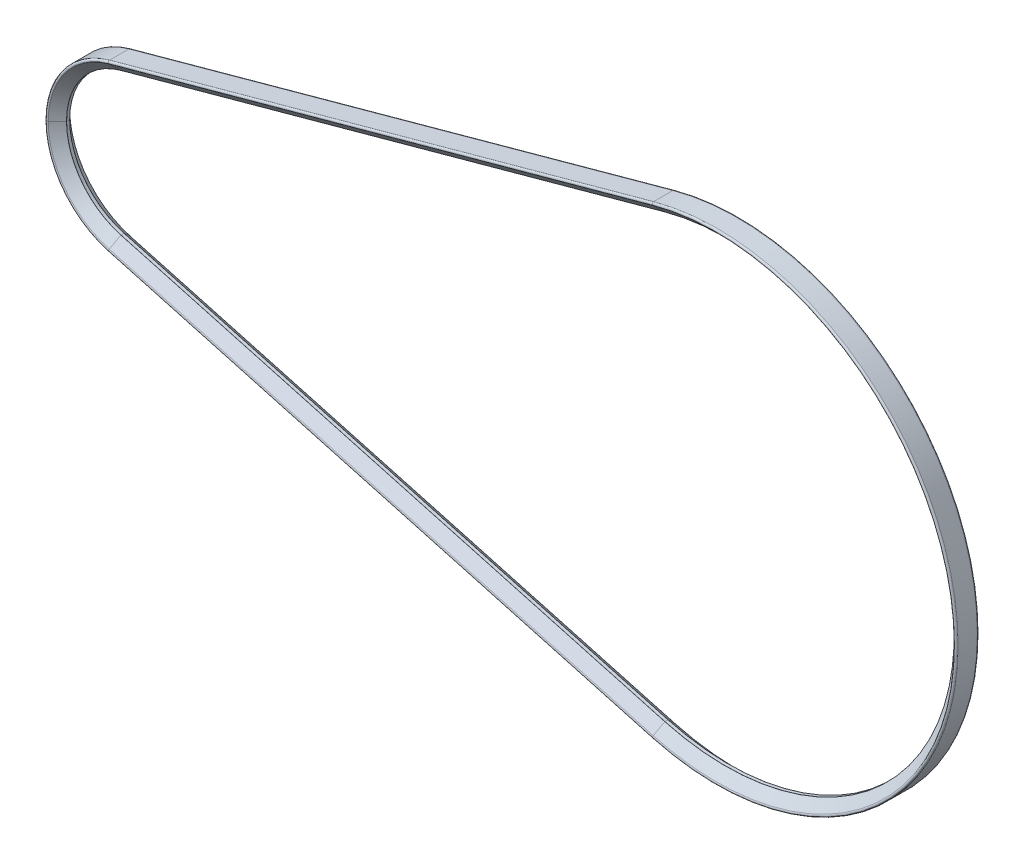
ISO-10303-21;
HEADER;
FILE_DESCRIPTION(('STEP AP214'),'2;1');
FILE_NAME('part.step','',(''),(''),'','','');
FILE_SCHEMA(('AUTOMOTIVE_DESIGN { 1 0 10303 214 1 1 1 1 }'));
ENDSEC;
DATA;
#1=APPLICATION_CONTEXT('core data for automotive mechanical design processes');
#2=APPLICATION_PROTOCOL_DEFINITION('international standard','automotive_design',2000,#1);
#3=PRODUCT_CONTEXT('',#1,'mechanical');
#4=PRODUCT('Part','Part','',(#3));
#5=PRODUCT_RELATED_PRODUCT_CATEGORY('part','',(#4));
#6=PRODUCT_DEFINITION_FORMATION('','',#4);
#7=PRODUCT_DEFINITION_CONTEXT('part definition',#1,'design');
#8=PRODUCT_DEFINITION('design','',#6,#7);
#9=PRODUCT_DEFINITION_SHAPE('','',#8);
#10=(LENGTH_UNIT() NAMED_UNIT(*) SI_UNIT(.MILLI.,.METRE.));
#11=(NAMED_UNIT(*) PLANE_ANGLE_UNIT() SI_UNIT($,.RADIAN.));
#12=(NAMED_UNIT(*) SI_UNIT($,.STERADIAN.) SOLID_ANGLE_UNIT());
#13=UNCERTAINTY_MEASURE_WITH_UNIT(LENGTH_MEASURE(1.E-05),#10,'distance_accuracy_value','');
#14=(GEOMETRIC_REPRESENTATION_CONTEXT(3) GLOBAL_UNCERTAINTY_ASSIGNED_CONTEXT((#13)) GLOBAL_UNIT_ASSIGNED_CONTEXT((#10,
#11,#12)) REPRESENTATION_CONTEXT('',''));
#15=CARTESIAN_POINT('',(0.,0.,0.));
#16=DIRECTION('',(0.,0.,1.));
#17=DIRECTION('',(1.,0.,0.));
#18=AXIS2_PLACEMENT_3D('',#15,#16,#17);
#19=CARTESIAN_POINT('',(-36.9999999999975,-8.77076189453874E-12,0.));
#20=DIRECTION('',(0.,0.,-1.));
#21=DIRECTION('',(-1.,0.,0.));
#22=AXIS2_PLACEMENT_3D('',#19,#20,#21);
#23=CYLINDRICAL_SURFACE('',#22,4.675);
#24=DIRECTION('',(0.,0.,-1.));
#25=VECTOR('',#24,1.);
#26=CARTESIAN_POINT('',(-38.2382432432398,-4.50803490122292,0.0999999999999893));
#27=LINE('',#26,#25);
#28=CARTESIAN_POINT('',(-38.2382432432398,-4.50803490122292,0.095857864376263));
#29=VERTEX_POINT('',#28);
#30=CARTESIAN_POINT('',(-38.2382432432398,-4.50803490122292,-0.0958578643762605));
#31=VERTEX_POINT('',#30);
#32=EDGE_CURVE('E220',#29,#31,#27,.T.);
#33=ORIENTED_EDGE('',*,*,#32,.T.);
#34=CARTESIAN_POINT('',(-36.9999999999975,-8.77076189453874E-12,-0.0958578643762606));
#35=DIRECTION('',(0.,0.,1.));
#36=DIRECTION('',(1.,0.,0.));
#37=AXIS2_PLACEMENT_3D('',#34,#35,#36);
#38=CIRCLE('',#37,4.675);
#39=CARTESIAN_POINT('',(-41.6749999999975,0.,-0.0958578643762606));
#40=VERTEX_POINT('',#39);
#41=EDGE_CURVE('E306',#31,#40,#38,.F.);
#42=ORIENTED_EDGE('',*,*,#41,.T.);
#43=DIRECTION('',(0.,0.,-1.));
#44=VECTOR('',#43,1.);
#45=CARTESIAN_POINT('',(-41.6749999999975,0.,0.0999999999999893));
#46=LINE('',#45,#44);
#47=CARTESIAN_POINT('',(-41.6749999999975,0.,0.0958578643762572));
#48=VERTEX_POINT('',#47);
#49=EDGE_CURVE('E192',#48,#40,#46,.T.);
#50=ORIENTED_EDGE('',*,*,#49,.F.);
#51=CARTESIAN_POINT('',(-36.9999999999975,-8.77076189453874E-12,0.0958578643762572));
#52=DIRECTION('',(0.,0.,1.));
#53=DIRECTION('',(1.,0.,0.));
#54=AXIS2_PLACEMENT_3D('',#51,#52,#53);
#55=CIRCLE('',#54,4.675);
#56=EDGE_CURVE('E304',#48,#29,#55,.T.);
#57=ORIENTED_EDGE('',*,*,#56,.T.);
#58=EDGE_LOOP('',(#33,#42,#50,#57));
#59=FACE_BOUND('',#58,.T.);
#60=ADVANCED_FACE('F39',(#59),#23,.F.);
#61=CARTESIAN_POINT('',(-36.9999999999975,-8.77076189453874E-12,0.85));
#62=DIRECTION('',(0.,0.,1.));
#63=DIRECTION('',(1.,0.,0.));
#64=AXIS2_PLACEMENT_3D('',#61,#62,#63);
#65=CONICAL_SURFACE('',#64,5.425,0.785398163397442);
#66=DIRECTION('',(0.187287742042575,0.681852844593749,-0.707106781186552));
#67=VECTOR('',#66,1.);
#68=CARTESIAN_POINT('',(-38.4368918918869,-5.23124905649829,0.85));
#69=LINE('',#68,#67);
#70=CARTESIAN_POINT('',(-38.3916766311964,-5.0666352180022,0.679289321881344));
#71=VERTEX_POINT('',#70);
#72=CARTESIAN_POINT('',(-38.239019014468,-4.51085922818066,0.102928932188128));
#73=VERTEX_POINT('',#72);
#74=EDGE_CURVE('E225',#71,#73,#69,.T.);
#75=ORIENTED_EDGE('',*,*,#74,.T.);
#76=CARTESIAN_POINT('',(-36.9999999999975,-8.77076189453874E-12,0.10292893218812));
#77=DIRECTION('',(0.,0.,-1.));
#78=DIRECTION('',(-1.,0.,0.));
#79=AXIS2_PLACEMENT_3D('',#76,#77,#78);
#80=CIRCLE('',#79,4.67792893218813);
#81=CARTESIAN_POINT('',(-41.6779289321857,0.,0.102928932188124));
#82=VERTEX_POINT('',#81);
#83=EDGE_CURVE('E61',#73,#82,#80,.T.);
#84=ORIENTED_EDGE('',*,*,#83,.T.);
#85=DIRECTION('',(0.707106781186543,0.,-0.707106781186552));
#86=VECTOR('',#85,1.);
#87=CARTESIAN_POINT('',(-42.4249999999975,0.,0.85));
#88=LINE('',#87,#86);
#89=CARTESIAN_POINT('',(-42.2542893218789,0.,0.679289321881346));
#90=VERTEX_POINT('',#89);
#91=EDGE_CURVE('E362',#90,#82,#88,.T.);
#92=ORIENTED_EDGE('',*,*,#91,.F.);
#93=CARTESIAN_POINT('',(-36.9999999999975,-8.77076189453874E-12,0.679289321881344));
#94=DIRECTION('',(0.,0.,-1.));
#95=DIRECTION('',(-1.,0.,0.));
#96=AXIS2_PLACEMENT_3D('',#93,#94,#95);
#97=CIRCLE('',#96,5.25428932188135);
#98=EDGE_CURVE('E253',#90,#71,#97,.F.);
#99=ORIENTED_EDGE('',*,*,#98,.T.);
#100=EDGE_LOOP('',(#75,#84,#92,#99));
#101=FACE_BOUND('',#100,.T.);
#102=ADVANCED_FACE('F449',(#101),#65,.F.);
#103=CARTESIAN_POINT('',(-36.9999999999975,-8.77076189453874E-12,0.));
#104=DIRECTION('',(0.,0.,-1.));
#105=DIRECTION('',(-1.,0.,0.));
#106=AXIS2_PLACEMENT_3D('',#103,#104,#105);
#107=CYLINDRICAL_SURFACE('',#106,5.425);
#108=DIRECTION('',(0.,0.,1.));
#109=VECTOR('',#108,1.);
#110=CARTESIAN_POINT('',(-42.4249999999975,0.,-0.85));
#111=LINE('',#110,#109);
#112=CARTESIAN_POINT('',(-42.4249999999975,0.,-0.608578643762691));
#113=VERTEX_POINT('',#112);
#114=CARTESIAN_POINT('',(-42.4249999999975,0.,0.608578643762692));
#115=VERTEX_POINT('',#114);
#116=EDGE_CURVE('E403',#113,#115,#111,.T.);
#117=ORIENTED_EDGE('',*,*,#116,.F.);
#118=CARTESIAN_POINT('',(-36.9999999999975,-8.77076189453874E-12,-0.608578643762691));
#119=DIRECTION('',(0.,0.,1.));
#120=DIRECTION('',(1.,0.,0.));
#121=AXIS2_PLACEMENT_3D('',#118,#119,#120);
#122=CIRCLE('',#121,5.425);
#123=CARTESIAN_POINT('',(-38.4368918918869,-5.23124905649829,-0.608578643762687));
#124=VERTEX_POINT('',#123);
#125=EDGE_CURVE('E234',#113,#124,#122,.T.);
#126=ORIENTED_EDGE('',*,*,#125,.T.);
#127=DIRECTION('',(0.,0.,1.));
#128=VECTOR('',#127,1.);
#129=CARTESIAN_POINT('',(-38.4368918918869,-5.23124905649829,-0.85));
#130=LINE('',#129,#128);
#131=CARTESIAN_POINT('',(-38.4368918918869,-5.23124905649829,0.60857864376269));
#132=VERTEX_POINT('',#131);
#133=EDGE_CURVE('E387',#124,#132,#130,.T.);
#134=ORIENTED_EDGE('',*,*,#133,.T.);
#135=CARTESIAN_POINT('',(-36.9999999999975,-8.77076189453874E-12,0.608578643762692));
#136=DIRECTION('',(0.,0.,1.));
#137=DIRECTION('',(1.,0.,0.));
#138=AXIS2_PLACEMENT_3D('',#135,#136,#137);
#139=CIRCLE('',#138,5.425);
#140=EDGE_CURVE('E232',#132,#115,#139,.F.);
#141=ORIENTED_EDGE('',*,*,#140,.T.);
#142=EDGE_LOOP('',(#117,#126,#134,#141));
#143=FACE_BOUND('',#142,.T.);
#144=ADVANCED_FACE('F462',(#143),#107,.T.);
#145=CARTESIAN_POINT('',(-3.83391891891587,-13.9580331968075,0.0999999999999893));
#146=DIRECTION('',(0.264864864864654,0.964285540366664,0.));
#147=DIRECTION('',(-0.964285540366664,0.264864864864654,0.));
#148=AXIS2_PLACEMENT_3D('',#145,#146,#147);
#149=PLANE('',#148);
#150=DIRECTION('',(0.,0.,-1.));
#151=VECTOR('',#150,1.);
#152=CARTESIAN_POINT('',(-3.83391891891586,-13.9580331968075,0.0999999999999893));
#153=LINE('',#152,#151);
#154=CARTESIAN_POINT('',(-3.83391891891586,-13.9580331968075,0.0958578643762621));
#155=VERTEX_POINT('',#154);
#156=CARTESIAN_POINT('',(-3.83391891891586,-13.9580331968075,-0.0958578643762595));
#157=VERTEX_POINT('',#156);
#158=EDGE_CURVE('E384',#155,#157,#153,.T.);
#159=ORIENTED_EDGE('',*,*,#158,.T.);
#160=DIRECTION('',(-0.964285540366664,0.264864864864654,0.));
#161=VECTOR('',#160,1.);
#162=CARTESIAN_POINT('',(-3.83391891891587,-13.9580331968075,-0.0958578643762595));
#163=LINE('',#162,#161);
#164=EDGE_CURVE('E320',#157,#31,#163,.T.);
#165=ORIENTED_EDGE('',*,*,#164,.T.);
#166=ORIENTED_EDGE('',*,*,#32,.F.);
#167=DIRECTION('',(-0.964285540366664,0.264864864864654,0.));
#168=VECTOR('',#167,1.);
#169=CARTESIAN_POINT('',(-3.83391891891587,-13.9580331968075,0.0958578643762621));
#170=LINE('',#169,#168);
#171=EDGE_CURVE('E318',#29,#155,#170,.F.);
#172=ORIENTED_EDGE('',*,*,#171,.T.);
#173=EDGE_LOOP('',(#159,#165,#166,#172));
#174=FACE_BOUND('',#173,.T.);
#175=ADVANCED_FACE('F515',(#174),#149,.T.);
#176=CARTESIAN_POINT('',(-4.032567567563,-14.6812473520828,0.85));
#177=DIRECTION('',(0.187287742043857,0.681852844593407,0.707106781186543));
#178=DIRECTION('',(0.,-0.719844357976628,0.694135505711396));
#179=AXIS2_PLACEMENT_3D('',#176,#177,#178);
#180=PLANE('',#179);
#181=DIRECTION('',(0.187287742042575,0.681852844593749,-0.707106781186552));
#182=VECTOR('',#181,1.);
#183=CARTESIAN_POINT('',(-4.03256756756299,-14.6812473520828,0.85));
#184=LINE('',#183,#182);
#185=CARTESIAN_POINT('',(-3.98735230687245,-14.5166335135867,0.679289321881347));
#186=VERTEX_POINT('',#185);
#187=CARTESIAN_POINT('',(-3.83469469014406,-13.9608575237652,0.102928932188125));
#188=VERTEX_POINT('',#187);
#189=EDGE_CURVE('E382',#186,#188,#184,.T.);
#190=ORIENTED_EDGE('',*,*,#189,.T.);
#191=DIRECTION('',(-0.964285540366664,0.264864864864654,0.));
#192=VECTOR('',#191,1.);
#193=CARTESIAN_POINT('',(-3.83469469014272,-13.9608575237656,0.102928932188125));
#194=LINE('',#193,#192);
#195=EDGE_CURVE('E11',#188,#73,#194,.T.);
#196=ORIENTED_EDGE('',*,*,#195,.T.);
#197=ORIENTED_EDGE('',*,*,#74,.F.);
#198=DIRECTION('',(-0.964285540366664,0.264864864864654,0.));
#199=VECTOR('',#198,1.);
#200=CARTESIAN_POINT('',(-3.98735230687215,-14.5166335135868,0.679289321881343));
#201=LINE('',#200,#199);
#202=EDGE_CURVE('E255',#71,#186,#201,.F.);
#203=ORIENTED_EDGE('',*,*,#202,.T.);
#204=EDGE_LOOP('',(#190,#196,#197,#203));
#205=FACE_BOUND('',#204,.T.);
#206=ADVANCED_FACE('F452',(#205),#180,.T.);
#207=CARTESIAN_POINT('',(-4.032567567563,-14.6812473520828,-0.85));
#208=DIRECTION('',(-0.264864864864654,-0.964285540366664,0.));
#209=DIRECTION('',(0.964285540366664,-0.264864864864654,0.));
#210=AXIS2_PLACEMENT_3D('',#207,#208,#209);
#211=PLANE('',#210);
#212=ORIENTED_EDGE('',*,*,#133,.F.);
#213=DIRECTION('',(-0.964285540366664,0.264864864864654,0.));
#214=VECTOR('',#213,1.);
#215=CARTESIAN_POINT('',(-4.032567567563,-14.6812473520828,-0.608578643762687));
#216=LINE('',#215,#214);
#217=CARTESIAN_POINT('',(-4.03256756756299,-14.6812473520828,-0.608578643762686));
#218=VERTEX_POINT('',#217);
#219=EDGE_CURVE('E241',#124,#218,#216,.F.);
#220=ORIENTED_EDGE('',*,*,#219,.T.);
#221=DIRECTION('',(0.,0.,1.));
#222=VECTOR('',#221,1.);
#223=CARTESIAN_POINT('',(-4.03256756756299,-14.6812473520828,-0.85));
#224=LINE('',#223,#222);
#225=CARTESIAN_POINT('',(-4.03256756756299,-14.6812473520828,0.60857864376269));
#226=VERTEX_POINT('',#225);
#227=EDGE_CURVE('E385',#218,#226,#224,.T.);
#228=ORIENTED_EDGE('',*,*,#227,.T.);
#229=DIRECTION('',(-0.964285540366664,0.264864864864654,0.));
#230=VECTOR('',#229,1.);
#231=CARTESIAN_POINT('',(-4.032567567563,-14.6812473520828,0.608578643762689));
#232=LINE('',#231,#230);
#233=EDGE_CURVE('E239',#226,#132,#232,.T.);
#234=ORIENTED_EDGE('',*,*,#233,.T.);
#235=EDGE_LOOP('',(#212,#220,#228,#234));
#236=FACE_BOUND('',#235,.T.);
#237=ADVANCED_FACE('F465',(#236),#211,.T.);
#238=CARTESIAN_POINT('',(-3.83391891891587,-13.9580331968075,-0.0999999999999893));
#239=DIRECTION('',(0.187287742043857,0.681852844593407,-0.707106781186543));
#240=DIRECTION('',(0.,0.719844357976628,0.694135505711396));
#241=AXIS2_PLACEMENT_3D('',#238,#239,#240);
#242=PLANE('',#241);
#243=DIRECTION('',(-0.187287742042575,-0.681852844593749,-0.707106781186552));
#244=VECTOR('',#243,1.);
#245=CARTESIAN_POINT('',(-38.2382432432398,-4.50803490122292,-0.0999999999999893));
#246=LINE('',#245,#244);
#247=CARTESIAN_POINT('',(-38.239019014468,-4.51085922818066,-0.102928932188126));
#248=VERTEX_POINT('',#247);
#249=CARTESIAN_POINT('',(-38.3916766311964,-5.0666352180022,-0.679289321881343));
#250=VERTEX_POINT('',#249);
#251=EDGE_CURVE('E393',#248,#250,#246,.T.);
#252=ORIENTED_EDGE('',*,*,#251,.F.);
#253=DIRECTION('',(-0.964285540366664,0.264864864864654,0.));
#254=VECTOR('',#253,1.);
#255=CARTESIAN_POINT('',(-3.83469469014408,-13.9608575237652,-0.102928932188125));
#256=LINE('',#255,#254);
#257=CARTESIAN_POINT('',(-3.83469469014406,-13.9608575237652,-0.102928932188124));
#258=VERTEX_POINT('',#257);
#259=EDGE_CURVE('E48',#248,#258,#256,.F.);
#260=ORIENTED_EDGE('',*,*,#259,.T.);
#261=DIRECTION('',(-0.187287742042575,-0.681852844593749,-0.707106781186552));
#262=VECTOR('',#261,1.);
#263=CARTESIAN_POINT('',(-3.83391891891586,-13.9580331968075,-0.0999999999999893));
#264=LINE('',#263,#262);
#265=CARTESIAN_POINT('',(-3.98735230687245,-14.5166335135867,-0.679289321881344));
#266=VERTEX_POINT('',#265);
#267=EDGE_CURVE('E391',#258,#266,#264,.T.);
#268=ORIENTED_EDGE('',*,*,#267,.T.);
#269=DIRECTION('',(-0.964285540366664,0.264864864864654,0.));
#270=VECTOR('',#269,1.);
#271=CARTESIAN_POINT('',(-3.98735230687351,-14.5166335135864,-0.679289321881342));
#272=LINE('',#271,#270);
#273=EDGE_CURVE('E236',#266,#250,#272,.T.);
#274=ORIENTED_EDGE('',*,*,#273,.T.);
#275=EDGE_LOOP('',(#252,#260,#268,#274));
#276=FACE_BOUND('',#275,.T.);
#277=ADVANCED_FACE('F414',(#276),#242,.T.);
#278=CARTESIAN_POINT('',(0.,0.,0.));
#279=DIRECTION('',(0.,0.,-1.));
#280=DIRECTION('',(-1.,0.,0.));
#281=AXIS2_PLACEMENT_3D('',#278,#279,#280);
#282=CYLINDRICAL_SURFACE('',#281,14.475);
#283=DIRECTION('',(0.,0.,-1.));
#284=VECTOR('',#283,1.);
#285=CARTESIAN_POINT('',(-3.83391891892245,13.9580331968056,0.0999999999999893));
#286=LINE('',#285,#284);
#287=CARTESIAN_POINT('',(-3.83391891892245,13.9580331968056,0.0958578643762515));
#288=VERTEX_POINT('',#287);
#289=CARTESIAN_POINT('',(-3.83391891892245,13.9580331968056,-0.0958578643762561));
#290=VERTEX_POINT('',#289);
#291=EDGE_CURVE('E380',#288,#290,#286,.T.);
#292=ORIENTED_EDGE('',*,*,#291,.T.);
#293=CARTESIAN_POINT('',(0.,0.,-0.0958578643762572));
#294=DIRECTION('',(0.,0.,1.));
#295=DIRECTION('',(1.,0.,0.));
#296=AXIS2_PLACEMENT_3D('',#293,#294,#295);
#297=CIRCLE('',#296,14.475);
#298=EDGE_CURVE('E287',#290,#157,#297,.F.);
#299=ORIENTED_EDGE('',*,*,#298,.T.);
#300=ORIENTED_EDGE('',*,*,#158,.F.);
#301=CARTESIAN_POINT('',(0.,0.,0.0958578643762612));
#302=DIRECTION('',(0.,0.,1.));
#303=DIRECTION('',(1.,0.,0.));
#304=AXIS2_PLACEMENT_3D('',#301,#302,#303);
#305=CIRCLE('',#304,14.475);
#306=EDGE_CURVE('E262',#155,#288,#305,.T.);
#307=ORIENTED_EDGE('',*,*,#306,.T.);
#308=EDGE_LOOP('',(#292,#299,#300,#307));
#309=FACE_BOUND('',#308,.T.);
#310=ADVANCED_FACE('F497',(#309),#282,.F.);
#311=CARTESIAN_POINT('',(0.,0.,0.85));
#312=DIRECTION('',(0.,0.,1.));
#313=DIRECTION('',(1.,0.,0.));
#314=AXIS2_PLACEMENT_3D('',#311,#312,#313);
#315=CONICAL_SURFACE('',#314,15.225,0.785398163397443);
#316=DIRECTION('',(0.187287742045456,-0.681852844592958,-0.707106781186552));
#317=VECTOR('',#316,1.);
#318=CARTESIAN_POINT('',(-4.03256756757264,14.6812473520802,0.85));
#319=LINE('',#318,#317);
#320=CARTESIAN_POINT('',(-3.9873523068814,14.5166335135843,0.67928932188134));
#321=VERTEX_POINT('',#320);
#322=CARTESIAN_POINT('',(-3.83469469015066,13.9608575237634,0.102928932188117));
#323=VERTEX_POINT('',#322);
#324=EDGE_CURVE('E378',#321,#323,#319,.T.);
#325=ORIENTED_EDGE('',*,*,#324,.T.);
#326=CARTESIAN_POINT('',(0.,0.,0.102928932188127));
#327=DIRECTION('',(0.,0.,-1.));
#328=DIRECTION('',(-1.,0.,0.));
#329=AXIS2_PLACEMENT_3D('',#326,#327,#328);
#330=CIRCLE('',#329,14.4779289321881);
#331=EDGE_CURVE('E310',#323,#188,#330,.T.);
#332=ORIENTED_EDGE('',*,*,#331,.T.);
#333=ORIENTED_EDGE('',*,*,#189,.F.);
#334=CARTESIAN_POINT('',(0.,0.,0.679289321881344));
#335=DIRECTION('',(0.,0.,-1.));
#336=DIRECTION('',(-1.,0.,0.));
#337=AXIS2_PLACEMENT_3D('',#334,#335,#336);
#338=CIRCLE('',#337,15.0542893218814);
#339=EDGE_CURVE('E213',#186,#321,#338,.F.);
#340=ORIENTED_EDGE('',*,*,#339,.T.);
#341=EDGE_LOOP('',(#325,#332,#333,#340));
#342=FACE_BOUND('',#341,.T.);
#343=ADVANCED_FACE('F508',(#342),#315,.F.);
#344=CARTESIAN_POINT('',(0.,0.,0.));
#345=DIRECTION('',(0.,0.,-1.));
#346=DIRECTION('',(-1.,0.,0.));
#347=AXIS2_PLACEMENT_3D('',#344,#345,#346);
#348=CYLINDRICAL_SURFACE('',#347,15.225);
#349=ORIENTED_EDGE('',*,*,#227,.F.);
#350=CARTESIAN_POINT('',(0.,0.,-0.608578643762686));
#351=DIRECTION('',(0.,0.,1.));
#352=DIRECTION('',(1.,0.,0.));
#353=AXIS2_PLACEMENT_3D('',#350,#351,#352);
#354=CIRCLE('',#353,15.225);
#355=CARTESIAN_POINT('',(-4.03256756757264,14.6812473520802,-0.608578643762691));
#356=VERTEX_POINT('',#355);
#357=EDGE_CURVE('E248',#218,#356,#354,.T.);
#358=ORIENTED_EDGE('',*,*,#357,.T.);
#359=DIRECTION('',(0.,0.,1.));
#360=VECTOR('',#359,1.);
#361=CARTESIAN_POINT('',(-4.03256756757264,14.6812473520802,-0.85));
#362=LINE('',#361,#360);
#363=CARTESIAN_POINT('',(-4.03256756757264,14.6812473520802,0.608578643762686));
#364=VERTEX_POINT('',#363);
#365=EDGE_CURVE('E381',#356,#364,#362,.T.);
#366=ORIENTED_EDGE('',*,*,#365,.T.);
#367=CARTESIAN_POINT('',(0.,0.,0.60857864376269));
#368=DIRECTION('',(0.,0.,1.));
#369=DIRECTION('',(1.,0.,0.));
#370=AXIS2_PLACEMENT_3D('',#367,#368,#369);
#371=CIRCLE('',#370,15.225);
#372=EDGE_CURVE('E246',#364,#226,#371,.F.);
#373=ORIENTED_EDGE('',*,*,#372,.T.);
#374=EDGE_LOOP('',(#349,#358,#366,#373));
#375=FACE_BOUND('',#374,.T.);
#376=ADVANCED_FACE('F431',(#375),#348,.T.);
#377=CARTESIAN_POINT('',(0.,0.,-0.0999999999999893));
#378=DIRECTION('',(0.,0.,-1.));
#379=DIRECTION('',(-1.,0.,0.));
#380=AXIS2_PLACEMENT_3D('',#377,#378,#379);
#381=CONICAL_SURFACE('',#380,14.475,0.785398163397442);
#382=ORIENTED_EDGE('',*,*,#267,.F.);
#383=CARTESIAN_POINT('',(0.,0.,-0.102928932188122));
#384=DIRECTION('',(0.,0.,1.));
#385=DIRECTION('',(1.,0.,0.));
#386=AXIS2_PLACEMENT_3D('',#383,#384,#385);
#387=CIRCLE('',#386,14.4779289321881);
#388=CARTESIAN_POINT('',(-3.83469469015066,13.9608575237634,-0.102928932188122));
#389=VERTEX_POINT('',#388);
#390=EDGE_CURVE('E290',#258,#389,#387,.T.);
#391=ORIENTED_EDGE('',*,*,#390,.T.);
#392=DIRECTION('',(-0.187287742045456,0.681852844592958,-0.707106781186552));
#393=VECTOR('',#392,1.);
#394=CARTESIAN_POINT('',(-3.83391891892245,13.9580331968056,-0.0999999999999893));
#395=LINE('',#394,#393);
#396=CARTESIAN_POINT('',(-3.9873523068814,14.5166335135843,-0.679289321881345));
#397=VERTEX_POINT('',#396);
#398=EDGE_CURVE('E371',#389,#397,#395,.T.);
#399=ORIENTED_EDGE('',*,*,#398,.T.);
#400=CARTESIAN_POINT('',(0.,0.,-0.679289321881337));
#401=DIRECTION('',(0.,0.,1.));
#402=DIRECTION('',(1.,0.,0.));
#403=AXIS2_PLACEMENT_3D('',#400,#401,#402);
#404=CIRCLE('',#403,15.0542893218814);
#405=EDGE_CURVE('E243',#397,#266,#404,.F.);
#406=ORIENTED_EDGE('',*,*,#405,.T.);
#407=EDGE_LOOP('',(#382,#391,#399,#406));
#408=FACE_BOUND('',#407,.T.);
#409=ADVANCED_FACE('F420',(#408),#381,.F.);
#410=CARTESIAN_POINT('',(-38.2382432432419,4.50803490120479,0.0999999999999893));
#411=DIRECTION('',(0.264864864865111,-0.964285540366538,0.));
#412=DIRECTION('',(0.964285540366538,0.264864864865111,0.));
#413=AXIS2_PLACEMENT_3D('',#410,#411,#412);
#414=PLANE('',#413);
#415=DIRECTION('',(0.,0.,-1.));
#416=VECTOR('',#415,1.);
#417=CARTESIAN_POINT('',(-38.2382432432419,4.5080349012048,0.0999999999999893));
#418=LINE('',#417,#416);
#419=CARTESIAN_POINT('',(-38.2382432432419,4.5080349012048,0.0958578643762579));
#420=VERTEX_POINT('',#419);
#421=CARTESIAN_POINT('',(-38.2382432432419,4.5080349012048,-0.0958578643762573));
#422=VERTEX_POINT('',#421);
#423=EDGE_CURVE('E368',#420,#422,#418,.T.);
#424=ORIENTED_EDGE('',*,*,#423,.T.);
#425=DIRECTION('',(0.964285540366538,0.264864864865111,0.));
#426=VECTOR('',#425,1.);
#427=CARTESIAN_POINT('',(-38.2382432432419,4.50803490120479,-0.0958578643762577));
#428=LINE('',#427,#426);
#429=EDGE_CURVE('E295',#422,#290,#428,.T.);
#430=ORIENTED_EDGE('',*,*,#429,.T.);
#431=ORIENTED_EDGE('',*,*,#291,.F.);
#432=DIRECTION('',(0.964285540366538,0.264864864865111,0.));
#433=VECTOR('',#432,1.);
#434=CARTESIAN_POINT('',(-38.2382432432419,4.50803490120479,0.0958578643762532));
#435=LINE('',#434,#433);
#436=EDGE_CURVE('E293',#288,#420,#435,.F.);
#437=ORIENTED_EDGE('',*,*,#436,.T.);
#438=EDGE_LOOP('',(#424,#430,#431,#437));
#439=FACE_BOUND('',#438,.T.);
#440=ADVANCED_FACE('F494',(#439),#414,.T.);
#441=CARTESIAN_POINT('',(-38.4368918918921,5.23124905647933,0.85));
#442=DIRECTION('',(0.18728774204418,-0.681852844593318,0.707106781186543));
#443=DIRECTION('',(0.,-0.719844357976673,-0.694135505711349));
#444=AXIS2_PLACEMENT_3D('',#441,#442,#443);
#445=PLANE('',#444);
#446=DIRECTION('',(0.187287742045457,-0.681852844592957,-0.707106781186552));
#447=VECTOR('',#446,1.);
#448=CARTESIAN_POINT('',(-38.4368918918921,5.23124905647933,0.85));
#449=LINE('',#448,#447);
#450=CARTESIAN_POINT('',(-38.3916766312009,5.06663521798343,0.679289321881342));
#451=VERTEX_POINT('',#450);
#452=CARTESIAN_POINT('',(-38.2390190144701,4.51085922816252,0.10292893218812));
#453=VERTEX_POINT('',#452);
#454=EDGE_CURVE('E360',#451,#453,#449,.T.);
#455=ORIENTED_EDGE('',*,*,#454,.T.);
#456=DIRECTION('',(0.964285540366538,0.264864864865111,0.));
#457=VECTOR('',#456,1.);
#458=CARTESIAN_POINT('',(-38.2390190144715,4.51085922816215,0.102928932188119));
#459=LINE('',#458,#457);
#460=EDGE_CURVE('E313',#453,#323,#459,.T.);
#461=ORIENTED_EDGE('',*,*,#460,.T.);
#462=ORIENTED_EDGE('',*,*,#324,.F.);
#463=DIRECTION('',(0.964285540366538,0.264864864865111,0.));
#464=VECTOR('',#463,1.);
#465=CARTESIAN_POINT('',(-38.3916766312012,5.06663521798334,0.679289321881342));
#466=LINE('',#465,#464);
#467=EDGE_CURVE('E261',#321,#451,#466,.F.);
#468=ORIENTED_EDGE('',*,*,#467,.T.);
#469=EDGE_LOOP('',(#455,#461,#462,#468));
#470=FACE_BOUND('',#469,.T.);
#471=ADVANCED_FACE('F364',(#470),#445,.T.);
#472=CARTESIAN_POINT('',(-38.4368918918921,5.23124905647933,-0.85));
#473=DIRECTION('',(-0.264864864865111,0.964285540366538,0.));
#474=DIRECTION('',(-0.964285540366538,-0.264864864865111,0.));
#475=AXIS2_PLACEMENT_3D('',#472,#473,#474);
#476=PLANE('',#475);
#477=ORIENTED_EDGE('',*,*,#365,.F.);
#478=DIRECTION('',(0.964285540366538,0.264864864865111,0.));
#479=VECTOR('',#478,1.);
#480=CARTESIAN_POINT('',(-38.4368918918921,5.23124905647933,-0.608578643762692));
#481=LINE('',#480,#479);
#482=CARTESIAN_POINT('',(-38.4368918918921,5.23124905647933,-0.608578643762692));
#483=VERTEX_POINT('',#482);
#484=EDGE_CURVE('E259',#356,#483,#481,.F.);
#485=ORIENTED_EDGE('',*,*,#484,.T.);
#486=DIRECTION('',(0.,0.,1.));
#487=VECTOR('',#486,1.);
#488=CARTESIAN_POINT('',(-38.4368918918921,5.23124905647933,-0.85));
#489=LINE('',#488,#487);
#490=CARTESIAN_POINT('',(-38.4368918918921,5.23124905647933,0.608578643762688));
#491=VERTEX_POINT('',#490);
#492=EDGE_CURVE('E191',#483,#491,#489,.T.);
#493=ORIENTED_EDGE('',*,*,#492,.T.);
#494=DIRECTION('',(0.964285540366538,0.264864864865111,0.));
#495=VECTOR('',#494,1.);
#496=CARTESIAN_POINT('',(-38.4368918918921,5.23124905647933,0.608578643762688));
#497=LINE('',#496,#495);
#498=EDGE_CURVE('E212',#491,#364,#497,.T.);
#499=ORIENTED_EDGE('',*,*,#498,.T.);
#500=EDGE_LOOP('',(#477,#485,#493,#499));
#501=FACE_BOUND('',#500,.T.);
#502=ADVANCED_FACE('F434',(#501),#476,.T.);
#503=CARTESIAN_POINT('',(-38.2382432432419,4.50803490120479,-0.0999999999999893));
#504=DIRECTION('',(0.18728774204418,-0.681852844593318,-0.707106781186543));
#505=DIRECTION('',(0.,0.719844357976673,-0.694135505711349));
#506=AXIS2_PLACEMENT_3D('',#503,#504,#505);
#507=PLANE('',#506);
#508=ORIENTED_EDGE('',*,*,#398,.F.);
#509=DIRECTION('',(0.964285540366538,0.264864864865111,0.));
#510=VECTOR('',#509,1.);
#511=CARTESIAN_POINT('',(-38.2390190144701,4.51085922816252,-0.102928932188123));
#512=LINE('',#511,#510);
#513=CARTESIAN_POINT('',(-38.2390190144701,4.51085922816253,-0.102928932188119));
#514=VERTEX_POINT('',#513);
#515=EDGE_CURVE('E187',#389,#514,#512,.F.);
#516=ORIENTED_EDGE('',*,*,#515,.T.);
#517=DIRECTION('',(-0.187287742045457,0.681852844592957,-0.707106781186552));
#518=VECTOR('',#517,1.);
#519=CARTESIAN_POINT('',(-38.2382432432419,4.5080349012048,-0.0999999999999893));
#520=LINE('',#519,#518);
#521=CARTESIAN_POINT('',(-38.3916766312009,5.06663521798343,-0.679289321881344));
#522=VERTEX_POINT('',#521);
#523=EDGE_CURVE('E179',#514,#522,#520,.T.);
#524=ORIENTED_EDGE('',*,*,#523,.T.);
#525=DIRECTION('',(0.964285540366538,0.264864864865111,0.));
#526=VECTOR('',#525,1.);
#527=CARTESIAN_POINT('',(-38.3916766311998,5.06663521798371,-0.679289321881346));
#528=LINE('',#527,#526);
#529=EDGE_CURVE('E184',#522,#397,#528,.T.);
#530=ORIENTED_EDGE('',*,*,#529,.T.);
#531=EDGE_LOOP('',(#508,#516,#524,#530));
#532=FACE_BOUND('',#531,.T.);
#533=ADVANCED_FACE('F182',(#532),#507,.T.);
#534=CARTESIAN_POINT('',(-36.9999999999975,-8.77076189453874E-12,0.));
#535=DIRECTION('',(0.,0.,-1.));
#536=DIRECTION('',(-1.,0.,0.));
#537=AXIS2_PLACEMENT_3D('',#534,#535,#536);
#538=CYLINDRICAL_SURFACE('',#537,4.675);
#539=ORIENTED_EDGE('',*,*,#49,.T.);
#540=CARTESIAN_POINT('',(-36.9999999999975,-8.77076189453874E-12,-0.0958578643762573));
#541=DIRECTION('',(0.,0.,1.));
#542=DIRECTION('',(1.,0.,0.));
#543=AXIS2_PLACEMENT_3D('',#540,#541,#542);
#544=CIRCLE('',#543,4.675);
#545=EDGE_CURVE('E300',#40,#422,#544,.F.);
#546=ORIENTED_EDGE('',*,*,#545,.T.);
#547=ORIENTED_EDGE('',*,*,#423,.F.);
#548=CARTESIAN_POINT('',(-36.9999999999975,-8.77076189453874E-12,0.0958578643762579));
#549=DIRECTION('',(0.,0.,1.));
#550=DIRECTION('',(1.,0.,0.));
#551=AXIS2_PLACEMENT_3D('',#548,#549,#550);
#552=CIRCLE('',#551,4.675);
#553=EDGE_CURVE('E298',#420,#48,#552,.T.);
#554=ORIENTED_EDGE('',*,*,#553,.T.);
#555=EDGE_LOOP('',(#539,#546,#547,#554));
#556=FACE_BOUND('',#555,.T.);
#557=ADVANCED_FACE('F511',(#556),#538,.F.);
#558=CARTESIAN_POINT('',(-36.9999999999975,-8.77076189453874E-12,0.85));
#559=DIRECTION('',(0.,0.,1.));
#560=DIRECTION('',(1.,0.,0.));
#561=AXIS2_PLACEMENT_3D('',#558,#559,#560);
#562=CONICAL_SURFACE('',#561,5.425,0.785398163397442);
#563=ORIENTED_EDGE('',*,*,#91,.T.);
#564=CARTESIAN_POINT('',(-36.9999999999975,-8.77076189453874E-12,0.102928932188121));
#565=DIRECTION('',(0.,0.,-1.));
#566=DIRECTION('',(-1.,0.,0.));
#567=AXIS2_PLACEMENT_3D('',#564,#565,#566);
#568=CIRCLE('',#567,4.67792893218813);
#569=EDGE_CURVE('E315',#82,#453,#568,.T.);
#570=ORIENTED_EDGE('',*,*,#569,.T.);
#571=ORIENTED_EDGE('',*,*,#454,.F.);
#572=CARTESIAN_POINT('',(-36.9999999999975,-8.77076189453874E-12,0.679289321881343));
#573=DIRECTION('',(0.,0.,-1.));
#574=DIRECTION('',(-1.,0.,0.));
#575=AXIS2_PLACEMENT_3D('',#572,#573,#574);
#576=CIRCLE('',#575,5.25428932188134);
#577=EDGE_CURVE('E250',#451,#90,#576,.F.);
#578=ORIENTED_EDGE('',*,*,#577,.T.);
#579=EDGE_LOOP('',(#563,#570,#571,#578));
#580=FACE_BOUND('',#579,.T.);
#581=ADVANCED_FACE('F359',(#580),#562,.F.);
#582=CARTESIAN_POINT('',(-36.9999999999975,-8.77076189453874E-12,0.));
#583=DIRECTION('',(0.,0.,-1.));
#584=DIRECTION('',(-1.,0.,0.));
#585=AXIS2_PLACEMENT_3D('',#582,#583,#584);
#586=CYLINDRICAL_SURFACE('',#585,5.425);
#587=ORIENTED_EDGE('',*,*,#492,.F.);
#588=CARTESIAN_POINT('',(-36.9999999999975,-8.77076189453874E-12,-0.608578643762687));
#589=DIRECTION('',(0.,0.,1.));
#590=DIRECTION('',(1.,0.,0.));
#591=AXIS2_PLACEMENT_3D('',#588,#589,#590);
#592=CIRCLE('',#591,5.425);
#593=EDGE_CURVE('E202',#483,#113,#592,.T.);
#594=ORIENTED_EDGE('',*,*,#593,.T.);
#595=ORIENTED_EDGE('',*,*,#116,.T.);
#596=CARTESIAN_POINT('',(-36.9999999999975,-8.77076189453874E-12,0.608578643762688));
#597=DIRECTION('',(0.,0.,1.));
#598=DIRECTION('',(1.,0.,0.));
#599=AXIS2_PLACEMENT_3D('',#596,#597,#598);
#600=CIRCLE('',#599,5.425);
#601=EDGE_CURVE('E219',#115,#491,#600,.F.);
#602=ORIENTED_EDGE('',*,*,#601,.T.);
#603=EDGE_LOOP('',(#587,#594,#595,#602));
#604=FACE_BOUND('',#603,.T.);
#605=ADVANCED_FACE('F443',(#604),#586,.T.);
#606=CARTESIAN_POINT('',(-36.9999999999975,-8.77076189453874E-12,-0.0999999999999893));
#607=DIRECTION('',(0.,0.,-1.));
#608=DIRECTION('',(-1.,0.,0.));
#609=AXIS2_PLACEMENT_3D('',#606,#607,#608);
#610=CONICAL_SURFACE('',#609,4.675,0.785398163397442);
#611=ORIENTED_EDGE('',*,*,#523,.F.);
#612=CARTESIAN_POINT('',(-36.9999999999975,-8.77076189453874E-12,-0.102928932188121));
#613=DIRECTION('',(0.,0.,1.));
#614=DIRECTION('',(1.,0.,0.));
#615=AXIS2_PLACEMENT_3D('',#612,#613,#614);
#616=CIRCLE('',#615,4.67792893218813);
#617=CARTESIAN_POINT('',(-41.6779289321857,0.,-0.102928932188123));
#618=VERTEX_POINT('',#617);
#619=EDGE_CURVE('E302',#514,#618,#616,.T.);
#620=ORIENTED_EDGE('',*,*,#619,.T.);
#621=DIRECTION('',(-0.707106781186543,0.,-0.707106781186552));
#622=VECTOR('',#621,1.);
#623=CARTESIAN_POINT('',(-41.6749999999975,0.,-0.0999999999999893));
#624=LINE('',#623,#622);
#625=CARTESIAN_POINT('',(-42.2542893218789,0.,-0.679289321881343));
#626=VERTEX_POINT('',#625);
#627=EDGE_CURVE('E217',#618,#626,#624,.T.);
#628=ORIENTED_EDGE('',*,*,#627,.T.);
#629=CARTESIAN_POINT('',(-36.9999999999975,-8.77076189453874E-12,-0.679289321881343));
#630=DIRECTION('',(0.,0.,1.));
#631=DIRECTION('',(1.,0.,0.));
#632=AXIS2_PLACEMENT_3D('',#629,#630,#631);
#633=CIRCLE('',#632,5.25428932188134);
#634=EDGE_CURVE('E200',#626,#522,#633,.F.);
#635=ORIENTED_EDGE('',*,*,#634,.T.);
#636=EDGE_LOOP('',(#611,#620,#628,#635));
#637=FACE_BOUND('',#636,.T.);
#638=ADVANCED_FACE('F215',(#637),#610,.F.);
#639=CARTESIAN_POINT('',(-36.9999999999975,-8.77076189453874E-12,-0.0999999999999893));
#640=DIRECTION('',(0.,0.,-1.));
#641=DIRECTION('',(-1.,0.,0.));
#642=AXIS2_PLACEMENT_3D('',#639,#640,#641);
#643=CONICAL_SURFACE('',#642,4.675,0.785398163397442);
#644=ORIENTED_EDGE('',*,*,#627,.F.);
#645=CARTESIAN_POINT('',(-36.9999999999975,-8.77076189453874E-12,-0.102928932188123));
#646=DIRECTION('',(0.,0.,1.));
#647=DIRECTION('',(1.,0.,0.));
#648=AXIS2_PLACEMENT_3D('',#645,#646,#647);
#649=CIRCLE('',#648,4.67792893218813);
#650=EDGE_CURVE('E308',#618,#248,#649,.T.);
#651=ORIENTED_EDGE('',*,*,#650,.T.);
#652=ORIENTED_EDGE('',*,*,#251,.T.);
#653=CARTESIAN_POINT('',(-36.9999999999975,-8.77076189453874E-12,-0.679289321881345));
#654=DIRECTION('',(0.,0.,1.));
#655=DIRECTION('',(1.,0.,0.));
#656=AXIS2_PLACEMENT_3D('',#653,#654,#655);
#657=CIRCLE('',#656,5.25428932188135);
#658=EDGE_CURVE('E230',#250,#626,#657,.F.);
#659=ORIENTED_EDGE('',*,*,#658,.T.);
#660=EDGE_LOOP('',(#644,#651,#652,#659));
#661=FACE_BOUND('',#660,.T.);
#662=ADVANCED_FACE('F469',(#661),#643,.F.);
#663=CARTESIAN_POINT('',(-4.00608108107789,-14.5848187980458,-0.608578643762687));
#664=DIRECTION('',(-0.964285540366664,0.264864864864654,0.));
#665=DIRECTION('',(-0.264864864864654,-0.964285540366664,0.));
#666=AXIS2_PLACEMENT_3D('',#663,#664,#665);
#667=CYLINDRICAL_SURFACE('',#666,0.1);
#668=CARTESIAN_POINT('',(-38.4104054054008,-5.13482050246154,-0.608578643762689));
#669=DIRECTION('',(-0.964285540367513,0.264864864861561,-3.18109368921096E-12));
#670=DIRECTION('',(-0.264864864861561,-0.964285540367513,0.));
#671=AXIS2_PLACEMENT_3D('',#668,#669,#670);
#672=CIRCLE('',#671,0.1);
#673=EDGE_CURVE('E266',#250,#124,#672,.T.);
#674=ORIENTED_EDGE('',*,*,#673,.F.);
#675=ORIENTED_EDGE('',*,*,#273,.F.);
#676=CARTESIAN_POINT('',(-4.00608108107653,-14.5848187980462,-0.608578643762687));
#677=DIRECTION('',(0.964285540366663,-0.264864864864657,-4.52579033111574E-12));
#678=DIRECTION('',(0.264864864864657,0.964285540366663,0.));
#679=AXIS2_PLACEMENT_3D('',#676,#677,#678);
#680=CIRCLE('',#679,0.1);
#681=EDGE_CURVE('E269',#218,#266,#680,.T.);
#682=ORIENTED_EDGE('',*,*,#681,.F.);
#683=ORIENTED_EDGE('',*,*,#219,.F.);
#684=EDGE_LOOP('',(#674,#675,#682,#683));
#685=FACE_BOUND('',#684,.T.);
#686=ADVANCED_FACE('F424',(#685),#667,.T.);
#687=CARTESIAN_POINT('',(0.,0.,-0.608578643762686));
#688=DIRECTION('',(0.,0.,1.));
#689=DIRECTION('',(1.,0.,0.));
#690=AXIS2_PLACEMENT_3D('',#687,#688,#689);
#691=TOROIDAL_SURFACE('',#690,15.125,0.1);
#692=ORIENTED_EDGE('',*,*,#681,.T.);
#693=ORIENTED_EDGE('',*,*,#405,.F.);
#694=CARTESIAN_POINT('',(-4.00608108108612,14.5848187980435,-0.608578643762686));
#695=DIRECTION('',(-0.964285540366515,-0.264864864865197,-4.29334907600798E-12));
#696=DIRECTION('',(0.264864864865197,-0.964285540366515,0.));
#697=AXIS2_PLACEMENT_3D('',#694,#695,#696);
#698=CIRCLE('',#697,0.1);
#699=EDGE_CURVE('E211',#356,#397,#698,.T.);
#700=ORIENTED_EDGE('',*,*,#699,.F.);
#701=ORIENTED_EDGE('',*,*,#357,.F.);
#702=EDGE_LOOP('',(#692,#693,#700,#701));
#703=FACE_BOUND('',#702,.T.);
#704=ADVANCED_FACE('F428',(#703),#691,.T.);
#705=CARTESIAN_POINT('',(-36.9999999999975,-8.77076189453874E-12,-0.608578643762691));
#706=DIRECTION('',(0.,0.,1.));
#707=DIRECTION('',(1.,0.,0.));
#708=AXIS2_PLACEMENT_3D('',#705,#706,#707);
#709=TOROIDAL_SURFACE('',#708,5.325,0.1);
#710=ORIENTED_EDGE('',*,*,#673,.T.);
#711=ORIENTED_EDGE('',*,*,#125,.F.);
#712=CARTESIAN_POINT('',(-42.3249999999975,1.18034330275137E-13,-0.608578643762691));
#713=DIRECTION('',(-1.18034330275116E-12,1.,-2.84960080975847E-12));
#714=DIRECTION('',(0.,2.84960080975847E-12,1.));
#715=AXIS2_PLACEMENT_3D('',#712,#713,#714);
#716=CIRCLE('',#715,0.1);
#717=EDGE_CURVE('E205',#626,#113,#716,.T.);
#718=ORIENTED_EDGE('',*,*,#717,.F.);
#719=ORIENTED_EDGE('',*,*,#658,.F.);
#720=EDGE_LOOP('',(#710,#711,#718,#719));
#721=FACE_BOUND('',#720,.T.);
#722=ADVANCED_FACE('F467',(#721),#709,.T.);
#723=CARTESIAN_POINT('',(-38.4104054054043,5.13482050244305,-0.608578643762692));
#724=DIRECTION('',(0.964285540366538,0.264864864865111,0.));
#725=DIRECTION('',(-0.264864864865111,0.964285540366538,0.));
#726=AXIS2_PLACEMENT_3D('',#723,#724,#725);
#727=CYLINDRICAL_SURFACE('',#726,0.1);
#728=ORIENTED_EDGE('',*,*,#699,.T.);
#729=ORIENTED_EDGE('',*,*,#529,.F.);
#730=CARTESIAN_POINT('',(-38.4104054054056,5.13482050244267,-0.608578643762692));
#731=DIRECTION('',(-0.964285540366541,-0.2648648648651,-4.59679780059262E-12));
#732=DIRECTION('',(0.2648648648651,-0.964285540366541,0.));
#733=AXIS2_PLACEMENT_3D('',#730,#731,#732);
#734=CIRCLE('',#733,0.1);
#735=EDGE_CURVE('E198',#483,#522,#734,.T.);
#736=ORIENTED_EDGE('',*,*,#735,.F.);
#737=ORIENTED_EDGE('',*,*,#484,.F.);
#738=EDGE_LOOP('',(#728,#729,#736,#737));
#739=FACE_BOUND('',#738,.T.);
#740=ADVANCED_FACE('F209',(#739),#727,.T.);
#741=CARTESIAN_POINT('',(-36.9999999999975,-8.77076189453874E-12,-0.608578643762687));
#742=DIRECTION('',(0.,0.,1.));
#743=DIRECTION('',(1.,0.,0.));
#744=AXIS2_PLACEMENT_3D('',#741,#742,#743);
#745=TOROIDAL_SURFACE('',#744,5.325,0.1);
#746=ORIENTED_EDGE('',*,*,#717,.T.);
#747=ORIENTED_EDGE('',*,*,#593,.F.);
#748=ORIENTED_EDGE('',*,*,#735,.T.);
#749=ORIENTED_EDGE('',*,*,#634,.F.);
#750=EDGE_LOOP('',(#746,#747,#748,#749));
#751=FACE_BOUND('',#750,.T.);
#752=ADVANCED_FACE('F199',(#751),#745,.T.);
#753=CARTESIAN_POINT('',(-4.00608108107654,-14.5848187980462,0.608578643762689));
#754=DIRECTION('',(-0.964285540366664,0.264864864864654,0.));
#755=DIRECTION('',(-0.264864864864654,-0.964285540366664,0.));
#756=AXIS2_PLACEMENT_3D('',#753,#754,#755);
#757=CYLINDRICAL_SURFACE('',#756,0.1);
#758=CARTESIAN_POINT('',(-38.4104054054004,-5.13482050246163,0.60857864376269));
#759=DIRECTION('',(-0.964285540366656,0.264864864864681,-4.63481662691877E-12));
#760=DIRECTION('',(-0.264864864864681,-0.964285540366656,0.));
#761=AXIS2_PLACEMENT_3D('',#758,#759,#760);
#762=CIRCLE('',#761,0.1);
#763=EDGE_CURVE('E280',#132,#71,#762,.T.);
#764=ORIENTED_EDGE('',*,*,#763,.F.);
#765=ORIENTED_EDGE('',*,*,#233,.F.);
#766=CARTESIAN_POINT('',(-4.00608108107684,-14.5848187980461,0.608578643762689));
#767=DIRECTION('',(0.96428554036751,-0.264864864861573,-3.19504367394757E-12));
#768=DIRECTION('',(0.264864864861573,0.96428554036751,0.));
#769=AXIS2_PLACEMENT_3D('',#766,#767,#768);
#770=CIRCLE('',#769,0.1);
#771=EDGE_CURVE('E206',#186,#226,#770,.T.);
#772=ORIENTED_EDGE('',*,*,#771,.F.);
#773=ORIENTED_EDGE('',*,*,#202,.F.);
#774=EDGE_LOOP('',(#764,#765,#772,#773));
#775=FACE_BOUND('',#774,.T.);
#776=ADVANCED_FACE('F457',(#775),#757,.T.);
#777=CARTESIAN_POINT('',(0.,0.,0.60857864376269));
#778=DIRECTION('',(0.,0.,1.));
#779=DIRECTION('',(1.,0.,0.));
#780=AXIS2_PLACEMENT_3D('',#777,#778,#779);
#781=TOROIDAL_SURFACE('',#780,15.125,0.1);
#782=ORIENTED_EDGE('',*,*,#771,.T.);
#783=ORIENTED_EDGE('',*,*,#372,.F.);
#784=CARTESIAN_POINT('',(-4.00608108108583,14.5848187980436,0.60857864376269));
#785=DIRECTION('',(-0.964285540365703,-0.264864864868152,-3.08607586864665E-12));
#786=DIRECTION('',(0.264864864868152,-0.964285540365703,0.));
#787=AXIS2_PLACEMENT_3D('',#784,#785,#786);
#788=CIRCLE('',#787,0.1);
#789=EDGE_CURVE('E277',#321,#364,#788,.T.);
#790=ORIENTED_EDGE('',*,*,#789,.F.);
#791=ORIENTED_EDGE('',*,*,#339,.F.);
#792=EDGE_LOOP('',(#782,#783,#790,#791));
#793=FACE_BOUND('',#792,.T.);
#794=ADVANCED_FACE('F548',(#793),#781,.T.);
#795=CARTESIAN_POINT('',(-36.9999999999975,-8.77076189453874E-12,0.608578643762692));
#796=DIRECTION('',(0.,0.,1.));
#797=DIRECTION('',(1.,0.,0.));
#798=AXIS2_PLACEMENT_3D('',#795,#796,#797);
#799=TOROIDAL_SURFACE('',#798,5.325,0.1);
#800=ORIENTED_EDGE('',*,*,#763,.T.);
#801=ORIENTED_EDGE('',*,*,#98,.F.);
#802=CARTESIAN_POINT('',(-42.3249999999975,-1.61673030314071E-13,0.608578643762692));
#803=DIRECTION('',(1.61673030314073E-12,1.,-3.90313222454207E-12));
#804=DIRECTION('',(0.,3.90313222454207E-12,1.));
#805=AXIS2_PLACEMENT_3D('',#802,#803,#804);
#806=CIRCLE('',#805,0.1);
#807=EDGE_CURVE('E274',#115,#90,#806,.T.);
#808=ORIENTED_EDGE('',*,*,#807,.F.);
#809=ORIENTED_EDGE('',*,*,#140,.F.);
#810=EDGE_LOOP('',(#800,#801,#808,#809));
#811=FACE_BOUND('',#810,.T.);
#812=ADVANCED_FACE('F460',(#811),#799,.T.);
#813=CARTESIAN_POINT('',(-38.4104054054056,5.13482050244267,0.608578643762688));
#814=DIRECTION('',(0.964285540366538,0.264864864865111,0.));
#815=DIRECTION('',(-0.264864864865111,0.964285540366538,0.));
#816=AXIS2_PLACEMENT_3D('',#813,#814,#815);
#817=CYLINDRICAL_SURFACE('',#816,0.1);
#818=ORIENTED_EDGE('',*,*,#789,.T.);
#819=ORIENTED_EDGE('',*,*,#498,.F.);
#820=CARTESIAN_POINT('',(-38.4104054054053,5.13482050244276,0.608578643762688));
#821=DIRECTION('',(-0.964285540365683,-0.264864864868222,-3.22145213561868E-12));
#822=DIRECTION('',(0.264864864868222,-0.964285540365684,0.));
#823=AXIS2_PLACEMENT_3D('',#820,#821,#822);
#824=CIRCLE('',#823,0.1);
#825=EDGE_CURVE('E272',#451,#491,#824,.T.);
#826=ORIENTED_EDGE('',*,*,#825,.F.);
#827=ORIENTED_EDGE('',*,*,#467,.F.);
#828=EDGE_LOOP('',(#818,#819,#826,#827));
#829=FACE_BOUND('',#828,.T.);
#830=ADVANCED_FACE('F439',(#829),#817,.T.);
#831=CARTESIAN_POINT('',(-36.9999999999975,-8.77076189453874E-12,0.608578643762688));
#832=DIRECTION('',(0.,0.,1.));
#833=DIRECTION('',(1.,0.,0.));
#834=AXIS2_PLACEMENT_3D('',#831,#832,#833);
#835=TOROIDAL_SURFACE('',#834,5.325,0.1);
#836=ORIENTED_EDGE('',*,*,#807,.T.);
#837=ORIENTED_EDGE('',*,*,#577,.F.);
#838=ORIENTED_EDGE('',*,*,#825,.T.);
#839=ORIENTED_EDGE('',*,*,#601,.F.);
#840=EDGE_LOOP('',(#836,#837,#838,#839));
#841=FACE_BOUND('',#840,.T.);
#842=ADVANCED_FACE('F447',(#841),#835,.T.);
#843=CARTESIAN_POINT('',(-36.9999999999975,-8.77076189453874E-12,-0.0958578643762573));
#844=DIRECTION('',(0.,0.,1.));
#845=DIRECTION('',(1.,0.,0.));
#846=AXIS2_PLACEMENT_3D('',#843,#844,#845);
#847=TOROIDAL_SURFACE('',#846,4.685,0.01);
#848=CARTESIAN_POINT('',(-38.2408918918906,4.51767775660846,-0.0958578643762573));
#849=DIRECTION('',(0.964285540366575,0.264864864864975,-9.00799427124472E-13));
#850=DIRECTION('',(-0.264864864864975,0.964285540366576,0.));
#851=AXIS2_PLACEMENT_3D('',#848,#849,#850);
#852=CIRCLE('',#851,0.01);
#853=EDGE_CURVE('E330',#422,#514,#852,.T.);
#854=ORIENTED_EDGE('',*,*,#853,.F.);
#855=ORIENTED_EDGE('',*,*,#545,.F.);
#856=CARTESIAN_POINT('',(-41.6849999999975,0.,-0.0958578643762559));
#857=DIRECTION('',(-1.32577157577776E-12,-1.,5.49152567295317E-13));
#858=DIRECTION('',(1.,-1.32577157577776E-12,0.));
#859=AXIS2_PLACEMENT_3D('',#856,#857,#858);
#860=CIRCLE('',#859,0.01);
#861=EDGE_CURVE('E275',#618,#40,#860,.T.);
#862=ORIENTED_EDGE('',*,*,#861,.F.);
#863=ORIENTED_EDGE('',*,*,#619,.F.);
#864=EDGE_LOOP('',(#854,#855,#862,#863));
#865=FACE_BOUND('',#864,.T.);
#866=ADVANCED_FACE('F476',(#865),#847,.T.);
#867=CARTESIAN_POINT('',(-36.9999999999975,-8.77076189453874E-12,-0.0958578643762606));
#868=DIRECTION('',(0.,0.,1.));
#869=DIRECTION('',(1.,0.,0.));
#870=AXIS2_PLACEMENT_3D('',#867,#868,#869);
#871=TOROIDAL_SURFACE('',#870,4.685,0.01);
#872=ORIENTED_EDGE('',*,*,#861,.T.);
#873=ORIENTED_EDGE('',*,*,#41,.F.);
#874=CARTESIAN_POINT('',(-38.2408918918884,-4.51767775662659,-0.0958578643762589));
#875=DIRECTION('',(0.964285540366777,-0.264864864864241,8.71462784694763E-13));
#876=DIRECTION('',(0.264864864864241,0.964285540366777,0.));
#877=AXIS2_PLACEMENT_3D('',#874,#875,#876);
#878=CIRCLE('',#877,0.01);
#879=EDGE_CURVE('E327',#248,#31,#878,.T.);
#880=ORIENTED_EDGE('',*,*,#879,.F.);
#881=ORIENTED_EDGE('',*,*,#650,.F.);
#882=EDGE_LOOP('',(#872,#873,#880,#881));
#883=FACE_BOUND('',#882,.T.);
#884=ADVANCED_FACE('F480',(#883),#871,.T.);
#885=CARTESIAN_POINT('',(-38.2408918918906,4.51767775660846,-0.0958578643762577));
#886=DIRECTION('',(0.964285540366538,0.264864864865111,0.));
#887=DIRECTION('',(-0.264864864865111,0.964285540366538,0.));
#888=AXIS2_PLACEMENT_3D('',#885,#886,#887);
#889=CYLINDRICAL_SURFACE('',#888,0.01);
#890=ORIENTED_EDGE('',*,*,#853,.T.);
#891=ORIENTED_EDGE('',*,*,#515,.F.);
#892=CARTESIAN_POINT('',(-3.8365675675711,13.9676760522093,-0.0958578643762561));
#893=DIRECTION('',(0.964285540366542,0.264864864865096,-7.57177827192626E-13));
#894=DIRECTION('',(-0.264864864865096,0.964285540366542,0.));
#895=AXIS2_PLACEMENT_3D('',#892,#893,#894);
#896=CIRCLE('',#895,0.01);
#897=EDGE_CURVE('E325',#290,#389,#896,.T.);
#898=ORIENTED_EDGE('',*,*,#897,.F.);
#899=ORIENTED_EDGE('',*,*,#429,.F.);
#900=EDGE_LOOP('',(#890,#891,#898,#899));
#901=FACE_BOUND('',#900,.T.);
#902=ADVANCED_FACE('F491',(#901),#889,.T.);
#903=CARTESIAN_POINT('',(-3.83656756756452,-13.9676760522111,-0.0958578643762595));
#904=DIRECTION('',(-0.964285540366664,0.264864864864654,0.));
#905=DIRECTION('',(-0.264864864864654,-0.964285540366664,0.));
#906=AXIS2_PLACEMENT_3D('',#903,#904,#905);
#907=CYLINDRICAL_SURFACE('',#906,0.01);
#908=ORIENTED_EDGE('',*,*,#879,.T.);
#909=ORIENTED_EDGE('',*,*,#164,.F.);
#910=CARTESIAN_POINT('',(-3.8365675675645,-13.9676760522111,-0.0958578643762598));
#911=DIRECTION('',(0.964285540366799,-0.26486486486416,5.14442243725651E-13));
#912=DIRECTION('',(0.26486486486416,0.964285540366799,0.));
#913=AXIS2_PLACEMENT_3D('',#910,#911,#912);
#914=CIRCLE('',#913,0.01);
#915=EDGE_CURVE('E323',#258,#157,#914,.T.);
#916=ORIENTED_EDGE('',*,*,#915,.F.);
#917=ORIENTED_EDGE('',*,*,#259,.F.);
#918=EDGE_LOOP('',(#908,#909,#916,#917));
#919=FACE_BOUND('',#918,.T.);
#920=ADVANCED_FACE('F484',(#919),#907,.T.);
#921=CARTESIAN_POINT('',(0.,0.,-0.0958578643762572));
#922=DIRECTION('',(0.,0.,1.));
#923=DIRECTION('',(1.,0.,0.));
#924=AXIS2_PLACEMENT_3D('',#921,#922,#923);
#925=TOROIDAL_SURFACE('',#924,14.485,0.01);
#926=ORIENTED_EDGE('',*,*,#897,.T.);
#927=ORIENTED_EDGE('',*,*,#390,.F.);
#928=ORIENTED_EDGE('',*,*,#915,.T.);
#929=ORIENTED_EDGE('',*,*,#298,.F.);
#930=EDGE_LOOP('',(#926,#927,#928,#929));
#931=FACE_BOUND('',#930,.T.);
#932=ADVANCED_FACE('F487',(#931),#925,.T.);
#933=CARTESIAN_POINT('',(-36.9999999999975,-8.77076189453874E-12,0.0958578643762579));
#934=DIRECTION('',(0.,0.,1.));
#935=DIRECTION('',(1.,0.,0.));
#936=AXIS2_PLACEMENT_3D('',#933,#934,#935);
#937=TOROIDAL_SURFACE('',#936,4.685,0.01);
#938=CARTESIAN_POINT('',(-38.2408918918906,4.51767775660846,0.0958578643762565));
#939=DIRECTION('',(0.964285540366386,0.264864864865664,5.7211022308109E-13));
#940=DIRECTION('',(-0.264864864865664,0.964285540366386,0.));
#941=AXIS2_PLACEMENT_3D('',#938,#939,#940);
#942=CIRCLE('',#941,0.01);
#943=EDGE_CURVE('E341',#453,#420,#942,.T.);
#944=ORIENTED_EDGE('',*,*,#943,.F.);
#945=ORIENTED_EDGE('',*,*,#569,.F.);
#946=CARTESIAN_POINT('',(-41.6849999999975,0.,0.0958578643762579));
#947=DIRECTION('',(-1.87609880097028E-12,-1.,-7.77105567714639E-13));
#948=DIRECTION('',(1.,-1.87609880097028E-12,0.));
#949=AXIS2_PLACEMENT_3D('',#946,#947,#948);
#950=CIRCLE('',#949,0.01);
#951=EDGE_CURVE('E43',#48,#82,#950,.T.);
#952=ORIENTED_EDGE('',*,*,#951,.F.);
#953=ORIENTED_EDGE('',*,*,#553,.F.);
#954=EDGE_LOOP('',(#944,#945,#952,#953));
#955=FACE_BOUND('',#954,.T.);
#956=ADVANCED_FACE('F41',(#955),#937,.T.);
#957=CARTESIAN_POINT('',(-36.9999999999975,-8.77076189453874E-12,0.0958578643762572));
#958=DIRECTION('',(0.,0.,1.));
#959=DIRECTION('',(1.,0.,0.));
#960=AXIS2_PLACEMENT_3D('',#957,#958,#959);
#961=TOROIDAL_SURFACE('',#960,4.685,0.01);
#962=ORIENTED_EDGE('',*,*,#951,.T.);
#963=ORIENTED_EDGE('',*,*,#83,.F.);
#964=CARTESIAN_POINT('',(-38.2408918918884,-4.51767775662659,0.0958578643762572));
#965=DIRECTION('',(0.964285540366588,-0.264864864864931,-1.16766234268312E-12));
#966=DIRECTION('',(0.264864864864931,0.964285540366588,0.));
#967=AXIS2_PLACEMENT_3D('',#964,#965,#966);
#968=CIRCLE('',#967,0.01);
#969=EDGE_CURVE('E339',#29,#73,#968,.T.);
#970=ORIENTED_EDGE('',*,*,#969,.F.);
#971=ORIENTED_EDGE('',*,*,#56,.F.);
#972=EDGE_LOOP('',(#962,#963,#970,#971));
#973=FACE_BOUND('',#972,.T.);
#974=ADVANCED_FACE('F351',(#973),#961,.T.);
#975=CARTESIAN_POINT('',(-38.2408918918919,4.51767775660808,0.0958578643762532));
#976=DIRECTION('',(0.964285540366538,0.264864864865111,0.));
#977=DIRECTION('',(-0.264864864865111,0.964285540366538,0.));
#978=AXIS2_PLACEMENT_3D('',#975,#976,#977);
#979=CYLINDRICAL_SURFACE('',#978,0.01);
#980=ORIENTED_EDGE('',*,*,#943,.T.);
#981=ORIENTED_EDGE('',*,*,#436,.F.);
#982=CARTESIAN_POINT('',(-3.8365675675711,13.9676760522093,0.0958578643762519));
#983=DIRECTION('',(0.964285540366419,0.264864864865544,4.46629817922824E-13));
#984=DIRECTION('',(-0.264864864865544,0.964285540366419,0.));
#985=AXIS2_PLACEMENT_3D('',#982,#983,#984);
#986=CIRCLE('',#985,0.01);
#987=EDGE_CURVE('E337',#323,#288,#986,.T.);
#988=ORIENTED_EDGE('',*,*,#987,.F.);
#989=ORIENTED_EDGE('',*,*,#460,.F.);
#990=EDGE_LOOP('',(#980,#981,#988,#989));
#991=FACE_BOUND('',#990,.T.);
#992=ADVANCED_FACE('F509',(#991),#979,.T.);
#993=CARTESIAN_POINT('',(-3.83656756756316,-13.9676760522115,0.0958578643762621));
#994=DIRECTION('',(-0.964285540366664,0.264864864864654,0.));
#995=DIRECTION('',(-0.264864864864654,-0.964285540366664,0.));
#996=AXIS2_PLACEMENT_3D('',#993,#994,#995);
#997=CYLINDRICAL_SURFACE('',#996,0.01);
#998=ORIENTED_EDGE('',*,*,#969,.T.);
#999=ORIENTED_EDGE('',*,*,#195,.F.);
#1000=CARTESIAN_POINT('',(-3.83656756756451,-13.9676760522111,0.0958578643762621));
#1001=DIRECTION('',(0.964285540366665,-0.264864864864648,-6.59069149161209E-13));
#1002=DIRECTION('',(0.264864864864648,0.964285540366665,0.));
#1003=AXIS2_PLACEMENT_3D('',#1000,#1001,#1002);
#1004=CIRCLE('',#1003,0.01);
#1005=EDGE_CURVE('E335',#155,#188,#1004,.T.);
#1006=ORIENTED_EDGE('',*,*,#1005,.F.);
#1007=ORIENTED_EDGE('',*,*,#171,.F.);
#1008=EDGE_LOOP('',(#998,#999,#1006,#1007));
#1009=FACE_BOUND('',#1008,.T.);
#1010=ADVANCED_FACE('F506',(#1009),#997,.T.);
#1011=CARTESIAN_POINT('',(0.,0.,0.0958578643762612));
#1012=DIRECTION('',(0.,0.,1.));
#1013=DIRECTION('',(1.,0.,0.));
#1014=AXIS2_PLACEMENT_3D('',#1011,#1012,#1013);
#1015=TOROIDAL_SURFACE('',#1014,14.485,0.01);
#1016=ORIENTED_EDGE('',*,*,#987,.T.);
#1017=ORIENTED_EDGE('',*,*,#306,.F.);
#1018=ORIENTED_EDGE('',*,*,#1005,.T.);
#1019=ORIENTED_EDGE('',*,*,#331,.F.);
#1020=EDGE_LOOP('',(#1016,#1017,#1018,#1019));
#1021=FACE_BOUND('',#1020,.T.);
#1022=ADVANCED_FACE('F501',(#1021),#1015,.T.);
#1023=CLOSED_SHELL('',(#60,#102,#144,#175,#206,#237,#277,#310,#343,#376,#409,#440,#471,#502,
#533,#557,#581,#605,#638,#662,#686,#704,#722,#740,#752,#776,#794,#812,#830,#842,#866,#884,#902,
#920,#932,#956,#974,#992,#1010,#1022));
#1024=MANIFOLD_SOLID_BREP('B2',#1023);
#1025=ADVANCED_BREP_SHAPE_REPRESENTATION('',(#18,#1024),#14);
#1026=SHAPE_DEFINITION_REPRESENTATION(#9,#1025);
ENDSEC;
END-ISO-10303-21;
